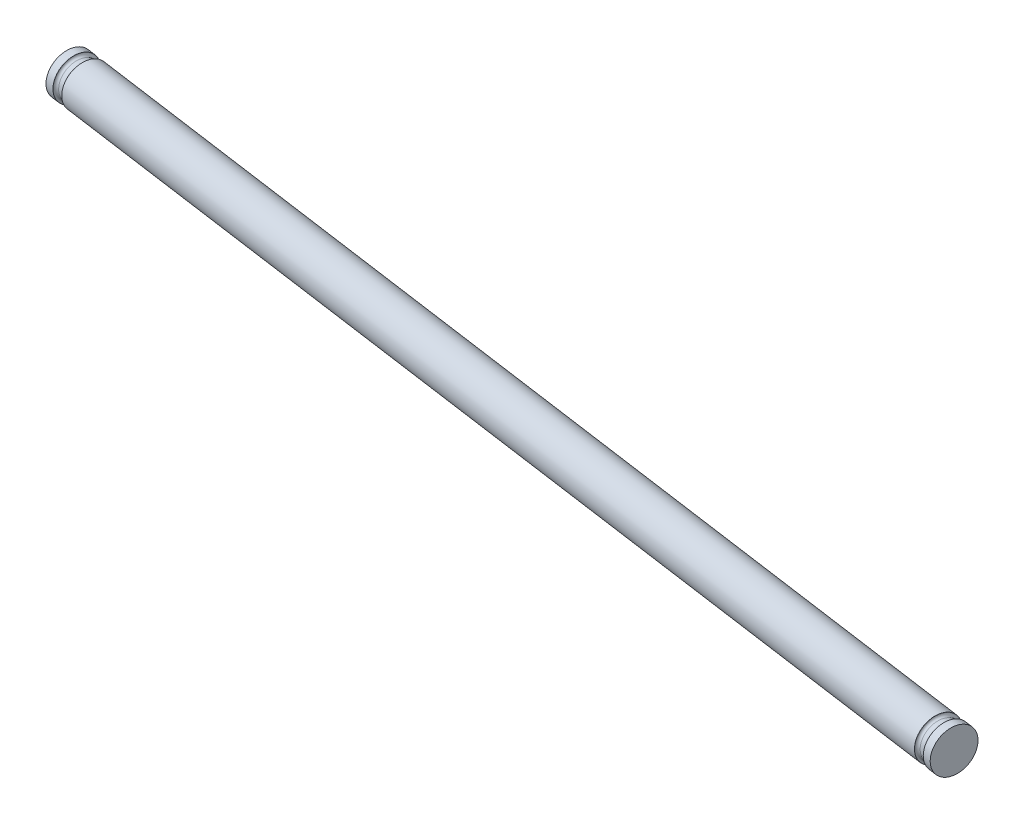
ISO-10303-21;
HEADER;
FILE_DESCRIPTION(('STEP AP214'),'2;1');
FILE_NAME('part.step','',(''),(''),'','','');
FILE_SCHEMA(('AUTOMOTIVE_DESIGN { 1 0 10303 214 1 1 1 1 }'));
ENDSEC;
DATA;
#1=APPLICATION_CONTEXT('core data for automotive mechanical design processes');
#2=APPLICATION_PROTOCOL_DEFINITION('international standard','automotive_design',2000,#1);
#3=PRODUCT_CONTEXT('',#1,'mechanical');
#4=PRODUCT('Part','Part','',(#3));
#5=PRODUCT_RELATED_PRODUCT_CATEGORY('part','',(#4));
#6=PRODUCT_DEFINITION_FORMATION('','',#4);
#7=PRODUCT_DEFINITION_CONTEXT('part definition',#1,'design');
#8=PRODUCT_DEFINITION('design','',#6,#7);
#9=PRODUCT_DEFINITION_SHAPE('','',#8);
#10=(LENGTH_UNIT() NAMED_UNIT(*) SI_UNIT(.MILLI.,.METRE.));
#11=(NAMED_UNIT(*) PLANE_ANGLE_UNIT() SI_UNIT($,.RADIAN.));
#12=(NAMED_UNIT(*) SI_UNIT($,.STERADIAN.) SOLID_ANGLE_UNIT());
#13=UNCERTAINTY_MEASURE_WITH_UNIT(LENGTH_MEASURE(1.E-05),#10,'distance_accuracy_value','');
#14=(GEOMETRIC_REPRESENTATION_CONTEXT(3) GLOBAL_UNCERTAINTY_ASSIGNED_CONTEXT((#13)) GLOBAL_UNIT_ASSIGNED_CONTEXT((#10,
#11,#12)) REPRESENTATION_CONTEXT('',''));
#15=CARTESIAN_POINT('',(0.,0.,0.));
#16=DIRECTION('',(0.,0.,1.));
#17=DIRECTION('',(1.,0.,0.));
#18=AXIS2_PLACEMENT_3D('',#15,#16,#17);
#19=CARTESIAN_POINT('',(-82.3160606755113,-23.74921875,-378.172721633891));
#20=DIRECTION('',(0.990268068741571,0.,0.139173100960058));
#21=DIRECTION('',(0.139173100960058,0.,-0.990268068741571));
#22=AXIS2_PLACEMENT_3D('',#19,#20,#21);
#23=CYLINDRICAL_SURFACE('',#22,3.90078125000752);
#24=CARTESIAN_POINT('',(-82.3160606755113,-23.74921875,-378.172721633891));
#25=DIRECTION('',(0.990268068741571,0.,0.139173100960058));
#26=DIRECTION('',(0.139173100960058,0.,-0.990268068741571));
#27=AXIS2_PLACEMENT_3D('',#24,#25,#26);
#28=CIRCLE('',#27,3.90078125000752);
#29=CARTESIAN_POINT('',(-81.7731768527809,-23.74921875,-382.035540748919));
#30=VERTEX_POINT('',#29);
#31=EDGE_CURVE('E62',#30,#30,#28,.T.);
#32=ORIENTED_EDGE('',*,*,#31,.T.);
#33=EDGE_LOOP('',(#32));
#34=FACE_BOUND('',#33,.T.);
#35=CARTESIAN_POINT('',(100.28627661272,-23.74921875,-352.509636732796));
#36=DIRECTION('',(0.990268068741571,0.,0.139173100960058));
#37=DIRECTION('',(0.139173100960058,0.,-0.990268068741571));
#38=AXIS2_PLACEMENT_3D('',#35,#36,#37);
#39=CIRCLE('',#38,3.90078125000752);
#40=CARTESIAN_POINT('',(100.82916043545,-23.74921875,-356.372455847825));
#41=VERTEX_POINT('',#40);
#42=EDGE_CURVE('E63',#41,#41,#39,.T.);
#43=ORIENTED_EDGE('',*,*,#42,.F.);
#44=EDGE_LOOP('',(#43));
#45=FACE_BOUND('',#44,.T.);
#46=ADVANCED_FACE('F39',(#34,#45),#23,.T.);
#47=CARTESIAN_POINT('',(-82.3160606755113,-23.74921875,-378.172721633891));
#48=DIRECTION('',(0.990268068741571,0.,0.139173100960058));
#49=DIRECTION('',(0.139173100960058,0.,-0.990268068741571));
#50=AXIS2_PLACEMENT_3D('',#47,#48,#49);
#51=PLANE('',#50);
#52=CARTESIAN_POINT('',(-82.3160606755109,-23.74921875,-378.172721633894));
#53=DIRECTION('',(-0.990268068741571,0.,-0.139173100960058));
#54=DIRECTION('',(-0.139173100960058,0.,0.990268068741571));
#55=AXIS2_PLACEMENT_3D('',#52,#53,#54);
#56=CIRCLE('',#55,3.85000000022037);
#57=CARTESIAN_POINT('',(-82.8518771142378,-23.74921875,-374.36018956902));
#58=VERTEX_POINT('',#57);
#59=EDGE_CURVE('E10',#58,#58,#56,.T.);
#60=ORIENTED_EDGE('',*,*,#59,.F.);
#61=EDGE_LOOP('',(#60));
#62=FACE_BOUND('',#61,.T.);
#63=ORIENTED_EDGE('',*,*,#31,.F.);
#64=EDGE_LOOP('',(#63));
#65=FACE_BOUND('',#64,.T.);
#66=ADVANCED_FACE('F111',(#62,#65),#51,.F.);
#67=CARTESIAN_POINT('',(100.28627661272,-23.74921875,-352.509636732796));
#68=DIRECTION('',(0.990268068741571,0.,0.139173100960058));
#69=DIRECTION('',(0.139173100960058,0.,-0.990268068741571));
#70=AXIS2_PLACEMENT_3D('',#67,#68,#69);
#71=PLANE('',#70);
#72=CARTESIAN_POINT('',(100.28627661272,-23.74921875,-352.509636732799));
#73=DIRECTION('',(0.990268068741571,0.,0.139173100960058));
#74=DIRECTION('',(0.139173100960058,0.,-0.990268068741571));
#75=AXIS2_PLACEMENT_3D('',#72,#73,#74);
#76=CIRCLE('',#75,3.85000000022037);
#77=CARTESIAN_POINT('',(100.822093051447,-23.74921875,-356.322168797673));
#78=VERTEX_POINT('',#77);
#79=EDGE_CURVE('E59',#78,#78,#76,.F.);
#80=ORIENTED_EDGE('',*,*,#79,.T.);
#81=EDGE_LOOP('',(#80));
#82=FACE_BOUND('',#81,.T.);
#83=ORIENTED_EDGE('',*,*,#42,.T.);
#84=EDGE_LOOP('',(#83));
#85=FACE_BOUND('',#84,.T.);
#86=ADVANCED_FACE('F118',(#82,#85),#71,.T.);
#87=CARTESIAN_POINT('',(102.16778594336,-23.74921875,-352.245207841194));
#88=DIRECTION('',(-0.990268068741571,0.,-0.139173100960058));
#89=DIRECTION('',(-0.139173100960058,0.,0.990268068741571));
#90=AXIS2_PLACEMENT_3D('',#87,#88,#89);
#91=PLANE('',#90);
#92=CARTESIAN_POINT('',(102.167785943329,-23.74921875,-352.245207840975));
#93=DIRECTION('',(-0.990268068741571,0.,-0.139173100960058));
#94=DIRECTION('',(-0.139173100960058,0.,0.990268068741571));
#95=AXIS2_PLACEMENT_3D('',#92,#93,#94);
#96=CIRCLE('',#95,3.85000000022037);
#97=CARTESIAN_POINT('',(101.631969504602,-23.74921875,-348.432675776102));
#98=VERTEX_POINT('',#97);
#99=EDGE_CURVE('E46',#98,#98,#96,.F.);
#100=ORIENTED_EDGE('',*,*,#99,.T.);
#101=EDGE_LOOP('',(#100));
#102=FACE_BOUND('',#101,.T.);
#103=CARTESIAN_POINT('',(102.167785943329,-23.74921875,-352.245207840975));
#104=DIRECTION('',(-0.990268068741571,0.,-0.139173100960058));
#105=DIRECTION('',(-0.139173100960058,0.,0.990268068741571));
#106=AXIS2_PLACEMENT_3D('',#103,#104,#105);
#107=CIRCLE('',#106,3.90078125000418);
#108=CARTESIAN_POINT('',(101.624902120599,-23.74921875,-348.38238872595));
#109=VERTEX_POINT('',#108);
#110=EDGE_CURVE('E66',#109,#109,#107,.T.);
#111=ORIENTED_EDGE('',*,*,#110,.T.);
#112=EDGE_LOOP('',(#111));
#113=FACE_BOUND('',#112,.T.);
#114=ADVANCED_FACE('F132',(#102,#113),#91,.T.);
#115=CARTESIAN_POINT('',(-94.2693739928945,-23.74921875,-379.852650264978));
#116=DIRECTION('',(-0.990268068741571,0.,-0.139173100960058));
#117=DIRECTION('',(-0.139173100960058,0.,0.990268068741571));
#118=AXIS2_PLACEMENT_3D('',#115,#116,#117);
#119=CYLINDRICAL_SURFACE('',#118,3.90078125000419);
#120=CARTESIAN_POINT('',(103.653188046441,-23.74921875,-352.036448189535));
#121=DIRECTION('',(-0.990268068741571,0.,-0.139173100960058));
#122=DIRECTION('',(-0.139173100960058,0.,0.990268068741571));
#123=AXIS2_PLACEMENT_3D('',#120,#121,#122);
#124=CIRCLE('',#123,3.9007812500042);
#125=CARTESIAN_POINT('',(103.110304223712,-23.74921875,-348.17362907451));
#126=VERTEX_POINT('',#125);
#127=EDGE_CURVE('E71',#126,#126,#124,.T.);
#128=ORIENTED_EDGE('',*,*,#127,.T.);
#129=EDGE_LOOP('',(#128));
#130=FACE_BOUND('',#129,.T.);
#131=ORIENTED_EDGE('',*,*,#110,.F.);
#132=EDGE_LOOP('',(#131));
#133=FACE_BOUND('',#132,.T.);
#134=ADVANCED_FACE('F136',(#130,#133),#119,.T.);
#135=CARTESIAN_POINT('',(103.653188046472,-23.74921875,-352.036448189753));
#136=DIRECTION('',(-0.990268068741571,0.,-0.139173100960058));
#137=DIRECTION('',(-0.139173100960058,0.,0.990268068741571));
#138=AXIS2_PLACEMENT_3D('',#135,#136,#137);
#139=PLANE('',#138);
#140=ORIENTED_EDGE('',*,*,#127,.F.);
#141=EDGE_LOOP('',(#140));
#142=FACE_BOUND('',#141,.T.);
#143=ADVANCED_FACE('F125',(#142),#139,.F.);
#144=CARTESIAN_POINT('',(-94.2693739928945,-23.74921875,-379.852650264978));
#145=DIRECTION('',(-0.990268068741571,0.,-0.139173100960058));
#146=DIRECTION('',(-0.139173100960058,0.,0.990268068741571));
#147=AXIS2_PLACEMENT_3D('',#144,#145,#146);
#148=CYLINDRICAL_SURFACE('',#147,3.35000000022037);
#149=CARTESIAN_POINT('',(100.781410647091,-23.74921875,-352.440050182319));
#150=DIRECTION('',(0.990268068741571,0.,0.139173100960058));
#151=DIRECTION('',(0.139173100960058,0.,-0.990268068741571));
#152=AXIS2_PLACEMENT_3D('',#149,#150,#151);
#153=CIRCLE('',#152,3.35000000022037);
#154=CARTESIAN_POINT('',(101.247640535338,-23.74921875,-355.757448212822));
#155=VERTEX_POINT('',#154);
#156=EDGE_CURVE('E50',#155,#155,#153,.T.);
#157=ORIENTED_EDGE('',*,*,#156,.T.);
#158=EDGE_LOOP('',(#157));
#159=FACE_BOUND('',#158,.T.);
#160=CARTESIAN_POINT('',(101.672651908958,-23.74921875,-352.314794391455));
#161=DIRECTION('',(-0.990268068741571,0.,-0.139173100960058));
#162=DIRECTION('',(-0.139173100960058,0.,0.990268068741571));
#163=AXIS2_PLACEMENT_3D('',#160,#161,#162);
#164=CIRCLE('',#163,3.35000000022037);
#165=CARTESIAN_POINT('',(101.206422020711,-23.74921875,-348.997396360953));
#166=VERTEX_POINT('',#165);
#167=EDGE_CURVE('E54',#166,#166,#164,.T.);
#168=ORIENTED_EDGE('',*,*,#167,.T.);
#169=EDGE_LOOP('',(#168));
#170=FACE_BOUND('',#169,.T.);
#171=ADVANCED_FACE('F123',(#159,#170),#148,.T.);
#172=CARTESIAN_POINT('',(100.781410647091,-23.74921875,-352.440050182319));
#173=DIRECTION('',(0.990268068741571,0.,0.139173100960058));
#174=DIRECTION('',(0.139173100960058,0.,-0.990268068741571));
#175=AXIS2_PLACEMENT_3D('',#172,#173,#174);
#176=TOROIDAL_SURFACE('',#175,3.85000000022037,0.5);
#177=ORIENTED_EDGE('',*,*,#156,.F.);
#178=EDGE_LOOP('',(#177));
#179=FACE_BOUND('',#178,.T.);
#180=ORIENTED_EDGE('',*,*,#79,.F.);
#181=EDGE_LOOP('',(#180));
#182=FACE_BOUND('',#181,.T.);
#183=ADVANCED_FACE('F106',(#179,#182),#176,.F.);
#184=CARTESIAN_POINT('',(101.672651908958,-23.74921875,-352.314794391455));
#185=DIRECTION('',(-0.990268068741571,0.,-0.139173100960058));
#186=DIRECTION('',(-0.139173100960058,0.,0.990268068741571));
#187=AXIS2_PLACEMENT_3D('',#184,#185,#186);
#188=TOROIDAL_SURFACE('',#187,3.85000000022037,0.5);
#189=ORIENTED_EDGE('',*,*,#99,.F.);
#190=EDGE_LOOP('',(#189));
#191=FACE_BOUND('',#190,.T.);
#192=ORIENTED_EDGE('',*,*,#167,.F.);
#193=EDGE_LOOP('',(#192));
#194=FACE_BOUND('',#193,.T.);
#195=ADVANCED_FACE('F41',(#191,#194),#188,.F.);
#196=CARTESIAN_POINT('',(-84.1975700060892,-23.74921875,-378.437150525936));
#197=DIRECTION('',(0.990268068741571,0.,0.139173100960058));
#198=DIRECTION('',(-0.139173100960058,0.,0.990268068741571));
#199=AXIS2_PLACEMENT_3D('',#196,#197,#198);
#200=PLANE('',#199);
#201=CARTESIAN_POINT('',(-84.1975700061199,-23.74921875,-378.437150525718));
#202=DIRECTION('',(-0.990268068741571,0.,-0.139173100960058));
#203=DIRECTION('',(-0.139173100960058,0.,0.990268068741571));
#204=AXIS2_PLACEMENT_3D('',#201,#202,#203);
#205=CIRCLE('',#204,3.85000000022037);
#206=CARTESIAN_POINT('',(-84.7333864448468,-23.74921875,-374.624618460845));
#207=VERTEX_POINT('',#206);
#208=EDGE_CURVE('E74',#207,#207,#205,.F.);
#209=ORIENTED_EDGE('',*,*,#208,.F.);
#210=EDGE_LOOP('',(#209));
#211=FACE_BOUND('',#210,.T.);
#212=CARTESIAN_POINT('',(-84.1975700061199,-23.74921875,-378.437150525718));
#213=DIRECTION('',(-0.990268068741571,0.,-0.139173100960058));
#214=DIRECTION('',(-0.139173100960058,0.,0.990268068741571));
#215=AXIS2_PLACEMENT_3D('',#212,#213,#214);
#216=CIRCLE('',#215,3.90078125000418);
#217=CARTESIAN_POINT('',(-84.7404538288498,-23.74921875,-374.574331410693));
#218=VERTEX_POINT('',#217);
#219=EDGE_CURVE('E83',#218,#218,#216,.T.);
#220=ORIENTED_EDGE('',*,*,#219,.F.);
#221=EDGE_LOOP('',(#220));
#222=FACE_BOUND('',#221,.T.);
#223=ADVANCED_FACE('F95',(#211,#222),#200,.T.);
#224=CARTESIAN_POINT('',(112.239589930104,-23.74921875,-350.829708101715));
#225=DIRECTION('',(0.990268068741571,0.,0.139173100960058));
#226=DIRECTION('',(-0.139173100960058,0.,0.990268068741571));
#227=AXIS2_PLACEMENT_3D('',#224,#225,#226);
#228=CYLINDRICAL_SURFACE('',#227,3.90078125000419);
#229=CARTESIAN_POINT('',(-85.6829721092322,-23.74921875,-378.645910177158));
#230=DIRECTION('',(-0.990268068741571,0.,-0.139173100960058));
#231=DIRECTION('',(-0.139173100960058,0.,0.990268068741571));
#232=AXIS2_PLACEMENT_3D('',#229,#230,#231);
#233=CIRCLE('',#232,3.9007812500042);
#234=CARTESIAN_POINT('',(-86.2258559319622,-23.74921875,-374.783091062133));
#235=VERTEX_POINT('',#234);
#236=EDGE_CURVE('E86',#235,#235,#233,.T.);
#237=ORIENTED_EDGE('',*,*,#236,.F.);
#238=EDGE_LOOP('',(#237));
#239=FACE_BOUND('',#238,.T.);
#240=ORIENTED_EDGE('',*,*,#219,.T.);
#241=EDGE_LOOP('',(#240));
#242=FACE_BOUND('',#241,.T.);
#243=ADVANCED_FACE('F92',(#239,#242),#228,.T.);
#244=CARTESIAN_POINT('',(-85.6829721092016,-23.74921875,-378.645910177376));
#245=DIRECTION('',(0.990268068741571,0.,0.139173100960058));
#246=DIRECTION('',(-0.139173100960058,0.,0.990268068741571));
#247=AXIS2_PLACEMENT_3D('',#244,#245,#246);
#248=PLANE('',#247);
#249=ORIENTED_EDGE('',*,*,#236,.T.);
#250=EDGE_LOOP('',(#249));
#251=FACE_BOUND('',#250,.T.);
#252=ADVANCED_FACE('F90',(#251),#248,.F.);
#253=CARTESIAN_POINT('',(112.239589930104,-23.74921875,-350.829708101715));
#254=DIRECTION('',(0.990268068741571,0.,0.139173100960058));
#255=DIRECTION('',(-0.139173100960058,0.,0.990268068741571));
#256=AXIS2_PLACEMENT_3D('',#253,#254,#255);
#257=CYLINDRICAL_SURFACE('',#256,3.35000000022037);
#258=CARTESIAN_POINT('',(-82.8111947098817,-23.74921875,-378.242308184374));
#259=DIRECTION('',(0.990268068741571,0.,0.139173100960058));
#260=DIRECTION('',(0.139173100960058,0.,-0.990268068741571));
#261=AXIS2_PLACEMENT_3D('',#258,#259,#260);
#262=CIRCLE('',#261,3.35000000022037);
#263=CARTESIAN_POINT('',(-82.3449648216348,-23.74921875,-381.559706214876));
#264=VERTEX_POINT('',#263);
#265=EDGE_CURVE('E77',#264,#264,#262,.T.);
#266=ORIENTED_EDGE('',*,*,#265,.F.);
#267=EDGE_LOOP('',(#266));
#268=FACE_BOUND('',#267,.T.);
#269=CARTESIAN_POINT('',(-83.7024359717491,-23.74921875,-378.367563975238));
#270=DIRECTION('',(-0.990268068741571,0.,-0.139173100960058));
#271=DIRECTION('',(-0.139173100960058,0.,0.990268068741571));
#272=AXIS2_PLACEMENT_3D('',#269,#270,#271);
#273=CIRCLE('',#272,3.35000000022037);
#274=CARTESIAN_POINT('',(-84.168665859996,-23.74921875,-375.050165944735));
#275=VERTEX_POINT('',#274);
#276=EDGE_CURVE('E80',#275,#275,#273,.T.);
#277=ORIENTED_EDGE('',*,*,#276,.F.);
#278=EDGE_LOOP('',(#277));
#279=FACE_BOUND('',#278,.T.);
#280=ADVANCED_FACE('F220',(#268,#279),#257,.T.);
#281=CARTESIAN_POINT('',(-82.8111947098817,-23.74921875,-378.242308184374));
#282=DIRECTION('',(-0.990268068741571,0.,-0.139173100960058));
#283=DIRECTION('',(0.139173100960058,0.,-0.990268068741571));
#284=AXIS2_PLACEMENT_3D('',#281,#282,#283);
#285=TOROIDAL_SURFACE('',#284,3.85000000022037,0.5);
#286=ORIENTED_EDGE('',*,*,#265,.T.);
#287=EDGE_LOOP('',(#286));
#288=FACE_BOUND('',#287,.T.);
#289=ORIENTED_EDGE('',*,*,#59,.T.);
#290=EDGE_LOOP('',(#289));
#291=FACE_BOUND('',#290,.T.);
#292=ADVANCED_FACE('F229',(#288,#291),#285,.F.);
#293=CARTESIAN_POINT('',(-83.7024359717491,-23.74921875,-378.367563975238));
#294=DIRECTION('',(0.990268068741571,0.,0.139173100960058));
#295=DIRECTION('',(-0.139173100960058,0.,0.990268068741571));
#296=AXIS2_PLACEMENT_3D('',#293,#294,#295);
#297=TOROIDAL_SURFACE('',#296,3.85000000022037,0.5);
#298=ORIENTED_EDGE('',*,*,#208,.T.);
#299=EDGE_LOOP('',(#298));
#300=FACE_BOUND('',#299,.T.);
#301=ORIENTED_EDGE('',*,*,#276,.T.);
#302=EDGE_LOOP('',(#301));
#303=FACE_BOUND('',#302,.T.);
#304=ADVANCED_FACE('F145',(#300,#303),#297,.F.);
#305=CLOSED_SHELL('',(#46,#66,#86,#114,#134,#143,#171,#183,#195,#223,#243,#252,#280,#292,#304));
#306=MANIFOLD_SOLID_BREP('B2',#305);
#307=ADVANCED_BREP_SHAPE_REPRESENTATION('',(#18,#306),#14);
#308=SHAPE_DEFINITION_REPRESENTATION(#9,#307);
ENDSEC;
END-ISO-10303-21;
